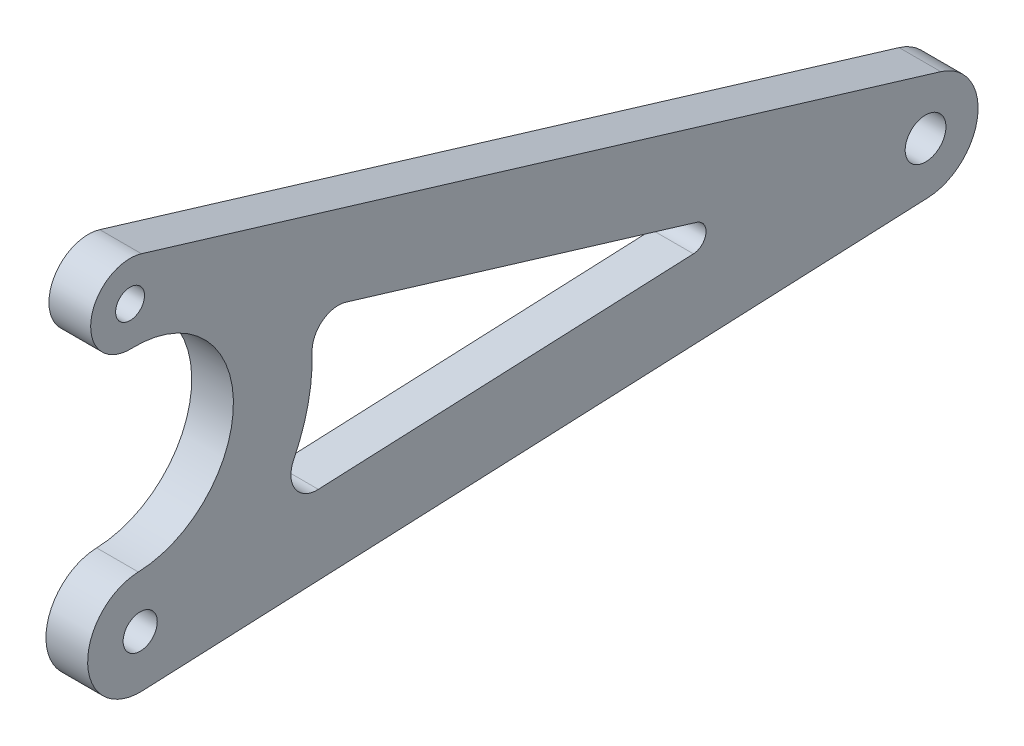
ISO-10303-21;
HEADER;
FILE_DESCRIPTION(('STEP AP214'),'2;1');
FILE_NAME('part.step','',(''),(''),'','','');
FILE_SCHEMA(('AUTOMOTIVE_DESIGN { 1 0 10303 214 1 1 1 1 }'));
ENDSEC;
DATA;
#1=APPLICATION_CONTEXT('core data for automotive mechanical design processes');
#2=APPLICATION_PROTOCOL_DEFINITION('international standard','automotive_design',2000,#1);
#3=PRODUCT_CONTEXT('',#1,'mechanical');
#4=PRODUCT('Part','Part','',(#3));
#5=PRODUCT_RELATED_PRODUCT_CATEGORY('part','',(#4));
#6=PRODUCT_DEFINITION_FORMATION('','',#4);
#7=PRODUCT_DEFINITION_CONTEXT('part definition',#1,'design');
#8=PRODUCT_DEFINITION('design','',#6,#7);
#9=PRODUCT_DEFINITION_SHAPE('','',#8);
#10=(LENGTH_UNIT() NAMED_UNIT(*) SI_UNIT(.MILLI.,.METRE.));
#11=(NAMED_UNIT(*) PLANE_ANGLE_UNIT() SI_UNIT($,.RADIAN.));
#12=(NAMED_UNIT(*) SI_UNIT($,.STERADIAN.) SOLID_ANGLE_UNIT());
#13=UNCERTAINTY_MEASURE_WITH_UNIT(LENGTH_MEASURE(1.E-05),#10,'distance_accuracy_value','');
#14=(GEOMETRIC_REPRESENTATION_CONTEXT(3) GLOBAL_UNCERTAINTY_ASSIGNED_CONTEXT((#13)) GLOBAL_UNIT_ASSIGNED_CONTEXT((#10,
#11,#12)) REPRESENTATION_CONTEXT('',''));
#15=CARTESIAN_POINT('',(0.,0.,0.));
#16=DIRECTION('',(0.,0.,1.));
#17=DIRECTION('',(1.,0.,0.));
#18=AXIS2_PLACEMENT_3D('',#15,#16,#17);
#19=CARTESIAN_POINT('',(14.14284,176.776695296636,176.776695296638));
#20=DIRECTION('',(-1.,0.,0.));
#21=DIRECTION('',(0.,0.,1.));
#22=AXIS2_PLACEMENT_3D('',#19,#20,#21);
#23=PLANE('',#22);
#24=DIRECTION('',(0.,0.0436193873653397,-0.999048221581858));
#25=VECTOR('',#24,1.);
#26=CARTESIAN_POINT('',(14.14284,179.19755656092,167.181027726338));
#27=LINE('',#26,#25);
#28=CARTESIAN_POINT('',(14.14284,179.370876706993,163.211343735848));
#29=VERTEX_POINT('',#28);
#30=CARTESIAN_POINT('',(14.14284,180.617968883603,134.648236905492));
#31=VERTEX_POINT('',#30);
#32=EDGE_CURVE('E164',#29,#31,#27,.T.);
#33=ORIENTED_EDGE('',*,*,#32,.F.);
#34=CARTESIAN_POINT('',(14.14284,181.368973150157,163.298582510579));
#35=DIRECTION('',(-1.,0.,0.));
#36=DIRECTION('',(0.,0.,1.));
#37=AXIS2_PLACEMENT_3D('',#34,#35,#36);
#38=CIRCLE('',#37,2.);
#39=CARTESIAN_POINT('',(14.14284,182.259649979283,165.089307164471));
#40=VERTEX_POINT('',#39);
#41=EDGE_CURVE('E50',#29,#40,#38,.T.);
#42=ORIENTED_EDGE('',*,*,#41,.T.);
#43=CARTESIAN_POINT('',(14.14284,188.273403115267,177.180085380396));
#44=DIRECTION('',(1.,0.,0.));
#45=DIRECTION('',(0.,0.,-1.));
#46=AXIS2_PLACEMENT_3D('',#43,#44,#45);
#47=CIRCLE('',#46,13.5037826051534);
#48=CARTESIAN_POINT('',(14.14284,188.682983667856,163.682515657732));
#49=VERTEX_POINT('',#48);
#50=EDGE_CURVE('E170',#49,#40,#47,.F.);
#51=ORIENTED_EDGE('',*,*,#50,.F.);
#52=CARTESIAN_POINT('',(14.14284,188.743645271284,161.683435826942));
#53=DIRECTION('',(-1.,0.,0.));
#54=DIRECTION('',(0.,0.,1.));
#55=AXIS2_PLACEMENT_3D('',#52,#53,#54);
#56=CIRCLE('',#55,2.);
#57=CARTESIAN_POINT('',(14.14284,190.657847872531,161.103928793872));
#58=VERTEX_POINT('',#57);
#59=EDGE_CURVE('E43',#49,#58,#56,.T.);
#60=ORIENTED_EDGE('',*,*,#59,.T.);
#61=DIRECTION('',(0.,0.289753516534974,0.95710130062372));
#62=VECTOR('',#61,1.);
#63=CARTESIAN_POINT('',(14.14284,180.873916630872,128.786069709408));
#64=LINE('',#63,#62);
#65=CARTESIAN_POINT('',(14.14284,182.574118405809,134.402102776322));
#66=VERTEX_POINT('',#65);
#67=EDGE_CURVE('E167',#66,#58,#64,.T.);
#68=ORIENTED_EDGE('',*,*,#67,.F.);
#69=CARTESIAN_POINT('',(14.14284,181.617017105185,134.691856292857));
#70=DIRECTION('',(-1.,0.,0.));
#71=DIRECTION('',(0.,0.,1.));
#72=AXIS2_PLACEMENT_3D('',#69,#70,#71);
#73=CIRCLE('',#72,1.);
#74=EDGE_CURVE('E186',#66,#31,#73,.T.);
#75=ORIENTED_EDGE('',*,*,#74,.T.);
#76=EDGE_LOOP('',(#33,#42,#51,#60,#68,#75));
#77=FACE_BOUND('',#76,.T.);
#78=CARTESIAN_POINT('',(14.14284,176.776695296636,176.776695296638));
#79=DIRECTION('',(1.,0.,0.));
#80=DIRECTION('',(0.,0.,1.));
#81=AXIS2_PLACEMENT_3D('',#78,#79,#80);
#82=CIRCLE('',#81,4.00000000000003);
#83=CARTESIAN_POINT('',(14.14284,180.774235310469,176.916958755224));
#84=VERTEX_POINT('',#83);
#85=CARTESIAN_POINT('',(14.14284,172.78050241031,176.602217747175));
#86=VERTEX_POINT('',#85);
#87=EDGE_CURVE('E135',#84,#86,#82,.T.);
#88=ORIENTED_EDGE('',*,*,#87,.T.);
#89=DIRECTION('',(0.,0.0436193873653399,-0.999048221581858));
#90=VECTOR('',#89,1.);
#91=CARTESIAN_POINT('',(14.14284,175.391522795918,116.800018993048));
#92=LINE('',#91,#90);
#93=CARTESIAN_POINT('',(14.14284,175.391522795918,116.800018993048));
#94=VERTEX_POINT('',#93);
#95=EDGE_CURVE('E124',#86,#94,#92,.T.);
#96=ORIENTED_EDGE('',*,*,#95,.T.);
#97=CARTESIAN_POINT('',(14.14284,179.387715682245,116.974496542509));
#98=DIRECTION('',(1.,0.,0.));
#99=DIRECTION('',(0.,0.,1.));
#100=AXIS2_PLACEMENT_3D('',#97,#98,#99);
#101=CIRCLE('',#100,4.00000000000002);
#102=CARTESIAN_POINT('',(14.14284,183.21612088474,115.81548247637));
#103=VERTEX_POINT('',#102);
#104=EDGE_CURVE('E134',#94,#103,#101,.T.);
#105=ORIENTED_EDGE('',*,*,#104,.T.);
#106=DIRECTION('',(0.,0.289753516534974,0.95710130062372));
#107=VECTOR('',#106,1.);
#108=CARTESIAN_POINT('',(14.14284,183.21612088474,115.81548247637));
#109=LINE('',#108,#107);
#110=CARTESIAN_POINT('',(14.14284,201.64202983231,176.679149049904));
#111=VERTEX_POINT('',#110);
#112=EDGE_CURVE('E387',#103,#111,#109,.T.);
#113=ORIENTED_EDGE('',*,*,#112,.T.);
#114=CARTESIAN_POINT('',(14.14284,198.770725930439,177.548409599509));
#115=DIRECTION('',(1.,0.,0.));
#116=DIRECTION('',(0.,0.,1.));
#117=AXIS2_PLACEMENT_3D('',#114,#115,#116);
#118=CIRCLE('',#117,3.);
#119=CARTESIAN_POINT('',(14.14284,195.772570920065,177.443212005568));
#120=VERTEX_POINT('',#119);
#121=EDGE_CURVE('E389',#111,#120,#118,.T.);
#122=ORIENTED_EDGE('',*,*,#121,.T.);
#123=CARTESIAN_POINT('',(14.14284,188.273403115267,177.180085380396));
#124=DIRECTION('',(-1.,0.,0.));
#125=DIRECTION('',(0.,0.,1.));
#126=AXIS2_PLACEMENT_3D('',#123,#124,#125);
#127=CIRCLE('',#126,7.50378260515293);
#128=EDGE_CURVE('E140',#120,#84,#127,.T.);
#129=ORIENTED_EDGE('',*,*,#128,.T.);
#130=EDGE_LOOP('',(#88,#96,#105,#113,#122,#129));
#131=FACE_BOUND('',#130,.T.);
#132=CARTESIAN_POINT('',(14.14284,179.387715682245,116.974496542509));
#133=DIRECTION('',(1.,0.,0.));
#134=DIRECTION('',(0.,0.,-1.));
#135=AXIS2_PLACEMENT_3D('',#132,#133,#134);
#136=CIRCLE('',#135,1.54999999999999);
#137=CARTESIAN_POINT('',(14.14284,179.387715682245,115.424496542509));
#138=VERTEX_POINT('',#137);
#139=EDGE_CURVE('E381',#138,#138,#136,.T.);
#140=ORIENTED_EDGE('',*,*,#139,.F.);
#141=EDGE_LOOP('',(#140));
#142=FACE_BOUND('',#141,.T.);
#143=CARTESIAN_POINT('',(14.14284,198.770725930439,177.548409599509));
#144=DIRECTION('',(1.,0.,0.));
#145=DIRECTION('',(0.,0.,-1.));
#146=AXIS2_PLACEMENT_3D('',#143,#144,#145);
#147=CIRCLE('',#146,1.09999999999999);
#148=CARTESIAN_POINT('',(14.14284,198.770725930439,176.448409599509));
#149=VERTEX_POINT('',#148);
#150=EDGE_CURVE('E375',#149,#149,#147,.T.);
#151=ORIENTED_EDGE('',*,*,#150,.F.);
#152=EDGE_LOOP('',(#151));
#153=FACE_BOUND('',#152,.T.);
#154=CARTESIAN_POINT('',(14.14284,176.776695296636,176.776695296638));
#155=DIRECTION('',(1.,0.,0.));
#156=DIRECTION('',(0.,0.,-1.));
#157=AXIS2_PLACEMENT_3D('',#154,#155,#156);
#158=CIRCLE('',#157,1.30000000000001);
#159=CARTESIAN_POINT('',(14.14284,176.776695296636,175.476695296638));
#160=VERTEX_POINT('',#159);
#161=EDGE_CURVE('E367',#160,#160,#158,.T.);
#162=ORIENTED_EDGE('',*,*,#161,.F.);
#163=EDGE_LOOP('',(#162));
#164=FACE_BOUND('',#163,.T.);
#165=ADVANCED_FACE('F35',(#77,#131,#142,#153,#164),#23,.F.);
#166=CARTESIAN_POINT('',(10.96784,176.776695296636,176.776695296638));
#167=DIRECTION('',(-1.,0.,0.));
#168=DIRECTION('',(0.,0.,1.));
#169=AXIS2_PLACEMENT_3D('',#166,#167,#168);
#170=PLANE('',#169);
#171=CARTESIAN_POINT('',(10.96784,188.273403115267,177.180085380396));
#172=DIRECTION('',(-1.,0.,0.));
#173=DIRECTION('',(0.,0.,1.));
#174=AXIS2_PLACEMENT_3D('',#171,#172,#173);
#175=CIRCLE('',#174,13.5037826051534);
#176=CARTESIAN_POINT('',(10.96784,182.259649979283,165.089307164471));
#177=VERTEX_POINT('',#176);
#178=CARTESIAN_POINT('',(10.96784,188.682983667856,163.682515657732));
#179=VERTEX_POINT('',#178);
#180=EDGE_CURVE('E160',#177,#179,#175,.F.);
#181=ORIENTED_EDGE('',*,*,#180,.F.);
#182=CARTESIAN_POINT('',(10.96784,181.368973150157,163.298582510579));
#183=DIRECTION('',(-1.,0.,0.));
#184=DIRECTION('',(0.,0.,1.));
#185=AXIS2_PLACEMENT_3D('',#182,#183,#184);
#186=CIRCLE('',#185,2.);
#187=CARTESIAN_POINT('',(10.96784,179.370876706993,163.211343735848));
#188=VERTEX_POINT('',#187);
#189=EDGE_CURVE('E191',#177,#188,#186,.F.);
#190=ORIENTED_EDGE('',*,*,#189,.T.);
#191=DIRECTION('',(0.,-0.0436193873653397,0.999048221581858));
#192=VECTOR('',#191,1.);
#193=CARTESIAN_POINT('',(10.96784,178.774791739801,176.863934071369));
#194=LINE('',#193,#192);
#195=CARTESIAN_POINT('',(10.96784,180.617968883603,134.648236905492));
#196=VERTEX_POINT('',#195);
#197=EDGE_CURVE('E149',#196,#188,#194,.T.);
#198=ORIENTED_EDGE('',*,*,#197,.F.);
#199=CARTESIAN_POINT('',(10.96784,181.617017105185,134.691856292857));
#200=DIRECTION('',(-1.,0.,0.));
#201=DIRECTION('',(0.,0.,1.));
#202=AXIS2_PLACEMENT_3D('',#199,#200,#201);
#203=CIRCLE('',#202,1.);
#204=CARTESIAN_POINT('',(10.96784,182.574118405809,134.402102776322));
#205=VERTEX_POINT('',#204);
#206=EDGE_CURVE('E188',#196,#205,#203,.F.);
#207=ORIENTED_EDGE('',*,*,#206,.T.);
#208=DIRECTION('',(0.,-0.289753516534974,-0.95710130062372));
#209=VECTOR('',#208,1.);
#210=CARTESIAN_POINT('',(10.96784,193.838852505249,171.611285900949));
#211=LINE('',#210,#209);
#212=CARTESIAN_POINT('',(10.96784,190.657847872531,161.103928793872));
#213=VERTEX_POINT('',#212);
#214=EDGE_CURVE('E152',#213,#205,#211,.T.);
#215=ORIENTED_EDGE('',*,*,#214,.F.);
#216=CARTESIAN_POINT('',(10.96784,188.743645271284,161.683435826942));
#217=DIRECTION('',(-1.,0.,0.));
#218=DIRECTION('',(0.,0.,1.));
#219=AXIS2_PLACEMENT_3D('',#216,#217,#218);
#220=CIRCLE('',#219,2.);
#221=EDGE_CURVE('E12',#213,#179,#220,.F.);
#222=ORIENTED_EDGE('',*,*,#221,.T.);
#223=EDGE_LOOP('',(#181,#190,#198,#207,#215,#222));
#224=FACE_BOUND('',#223,.T.);
#225=CARTESIAN_POINT('',(10.96784,198.770725930439,177.548409599509));
#226=DIRECTION('',(1.,0.,0.));
#227=DIRECTION('',(0.,0.,-1.));
#228=AXIS2_PLACEMENT_3D('',#225,#226,#227);
#229=CIRCLE('',#228,1.09999999999999);
#230=CARTESIAN_POINT('',(10.96784,198.770725930439,176.448409599509));
#231=VERTEX_POINT('',#230);
#232=EDGE_CURVE('E372',#231,#231,#229,.T.);
#233=ORIENTED_EDGE('',*,*,#232,.T.);
#234=EDGE_LOOP('',(#233));
#235=FACE_BOUND('',#234,.T.);
#236=CARTESIAN_POINT('',(10.96784,176.776695296636,176.776695296638));
#237=DIRECTION('',(1.,0.,0.));
#238=DIRECTION('',(0.,0.,1.));
#239=AXIS2_PLACEMENT_3D('',#236,#237,#238);
#240=CIRCLE('',#239,4.00000000000003);
#241=CARTESIAN_POINT('',(10.96784,180.774235310469,176.916958755224));
#242=VERTEX_POINT('',#241);
#243=CARTESIAN_POINT('',(10.96784,172.78050241031,176.602217747175));
#244=VERTEX_POINT('',#243);
#245=EDGE_CURVE('E148',#242,#244,#240,.T.);
#246=ORIENTED_EDGE('',*,*,#245,.F.);
#247=CARTESIAN_POINT('',(10.96784,188.273403115267,177.180085380396));
#248=DIRECTION('',(-1.,0.,0.));
#249=DIRECTION('',(0.,0.,1.));
#250=AXIS2_PLACEMENT_3D('',#247,#248,#249);
#251=CIRCLE('',#250,7.50378260515293);
#252=CARTESIAN_POINT('',(10.96784,195.772570920065,177.443212005568));
#253=VERTEX_POINT('',#252);
#254=EDGE_CURVE('E144',#253,#242,#251,.T.);
#255=ORIENTED_EDGE('',*,*,#254,.F.);
#256=CARTESIAN_POINT('',(10.96784,198.770725930439,177.548409599509));
#257=DIRECTION('',(1.,0.,0.));
#258=DIRECTION('',(0.,0.,1.));
#259=AXIS2_PLACEMENT_3D('',#256,#257,#258);
#260=CIRCLE('',#259,3.);
#261=CARTESIAN_POINT('',(10.96784,201.64202983231,176.679149049904));
#262=VERTEX_POINT('',#261);
#263=EDGE_CURVE('E400',#262,#253,#260,.T.);
#264=ORIENTED_EDGE('',*,*,#263,.F.);
#265=DIRECTION('',(0.,0.289753516534974,0.95710130062372));
#266=VECTOR('',#265,1.);
#267=CARTESIAN_POINT('',(10.96784,183.21612088474,115.81548247637));
#268=LINE('',#267,#266);
#269=CARTESIAN_POINT('',(10.96784,183.21612088474,115.81548247637));
#270=VERTEX_POINT('',#269);
#271=EDGE_CURVE('E398',#270,#262,#268,.T.);
#272=ORIENTED_EDGE('',*,*,#271,.F.);
#273=CARTESIAN_POINT('',(10.96784,179.387715682245,116.974496542509));
#274=DIRECTION('',(1.,0.,0.));
#275=DIRECTION('',(0.,0.,1.));
#276=AXIS2_PLACEMENT_3D('',#273,#274,#275);
#277=CIRCLE('',#276,4.00000000000002);
#278=CARTESIAN_POINT('',(10.96784,175.391522795918,116.800018993048));
#279=VERTEX_POINT('',#278);
#280=EDGE_CURVE('E396',#279,#270,#277,.T.);
#281=ORIENTED_EDGE('',*,*,#280,.F.);
#282=DIRECTION('',(0.,0.0436193873653399,-0.999048221581858));
#283=VECTOR('',#282,1.);
#284=CARTESIAN_POINT('',(10.96784,175.391522795918,116.800018993048));
#285=LINE('',#284,#283);
#286=EDGE_CURVE('E394',#244,#279,#285,.T.);
#287=ORIENTED_EDGE('',*,*,#286,.F.);
#288=EDGE_LOOP('',(#246,#255,#264,#272,#281,#287));
#289=FACE_BOUND('',#288,.T.);
#290=CARTESIAN_POINT('',(10.96784,179.387715682245,116.974496542509));
#291=DIRECTION('',(1.,0.,0.));
#292=DIRECTION('',(0.,0.,-1.));
#293=AXIS2_PLACEMENT_3D('',#290,#291,#292);
#294=CIRCLE('',#293,1.54999999999999);
#295=CARTESIAN_POINT('',(10.96784,179.387715682245,115.424496542509));
#296=VERTEX_POINT('',#295);
#297=EDGE_CURVE('E378',#296,#296,#294,.T.);
#298=ORIENTED_EDGE('',*,*,#297,.T.);
#299=EDGE_LOOP('',(#298));
#300=FACE_BOUND('',#299,.T.);
#301=CARTESIAN_POINT('',(10.96784,176.776695296636,176.776695296638));
#302=DIRECTION('',(1.,0.,0.));
#303=DIRECTION('',(0.,0.,-1.));
#304=AXIS2_PLACEMENT_3D('',#301,#302,#303);
#305=CIRCLE('',#304,1.30000000000001);
#306=CARTESIAN_POINT('',(10.96784,176.776695296636,175.476695296638));
#307=VERTEX_POINT('',#306);
#308=EDGE_CURVE('E172',#307,#307,#305,.T.);
#309=ORIENTED_EDGE('',*,*,#308,.T.);
#310=EDGE_LOOP('',(#309));
#311=FACE_BOUND('',#310,.T.);
#312=ADVANCED_FACE('F200',(#224,#235,#289,#300,#311),#170,.T.);
#313=CARTESIAN_POINT('',(14.14284,176.776695296636,176.776695296638));
#314=DIRECTION('',(-1.,0.,0.));
#315=DIRECTION('',(0.,0.,1.));
#316=AXIS2_PLACEMENT_3D('',#313,#314,#315);
#317=CYLINDRICAL_SURFACE('',#316,4.00000000000003);
#318=ORIENTED_EDGE('',*,*,#245,.T.);
#319=DIRECTION('',(-1.,0.,0.));
#320=VECTOR('',#319,1.);
#321=CARTESIAN_POINT('',(14.14284,172.78050241031,176.602217747175));
#322=LINE('',#321,#320);
#323=EDGE_CURVE('E128',#86,#244,#322,.T.);
#324=ORIENTED_EDGE('',*,*,#323,.F.);
#325=ORIENTED_EDGE('',*,*,#87,.F.);
#326=DIRECTION('',(-1.,0.,0.));
#327=VECTOR('',#326,1.);
#328=CARTESIAN_POINT('',(14.14284,180.774235310469,176.916958755224));
#329=LINE('',#328,#327);
#330=EDGE_CURVE('E392',#84,#242,#329,.T.);
#331=ORIENTED_EDGE('',*,*,#330,.T.);
#332=EDGE_LOOP('',(#318,#324,#325,#331));
#333=FACE_BOUND('',#332,.T.);
#334=ADVANCED_FACE('F146',(#333),#317,.T.);
#335=CARTESIAN_POINT('',(14.14284,175.391522795918,116.800018993048));
#336=DIRECTION('',(0.,0.999048221581857,0.0436193873653399));
#337=DIRECTION('',(0.,-0.0436193873653399,0.999048221581858));
#338=AXIS2_PLACEMENT_3D('',#335,#336,#337);
#339=PLANE('',#338);
#340=ORIENTED_EDGE('',*,*,#286,.T.);
#341=DIRECTION('',(-1.,0.,0.));
#342=VECTOR('',#341,1.);
#343=CARTESIAN_POINT('',(14.14284,175.391522795918,116.800018993048));
#344=LINE('',#343,#342);
#345=EDGE_CURVE('E131',#94,#279,#344,.T.);
#346=ORIENTED_EDGE('',*,*,#345,.F.);
#347=ORIENTED_EDGE('',*,*,#95,.F.);
#348=ORIENTED_EDGE('',*,*,#323,.T.);
#349=EDGE_LOOP('',(#340,#346,#347,#348));
#350=FACE_BOUND('',#349,.T.);
#351=ADVANCED_FACE('F126',(#350),#339,.F.);
#352=CARTESIAN_POINT('',(14.14284,179.387715682245,116.974496542509));
#353=DIRECTION('',(-1.,0.,0.));
#354=DIRECTION('',(0.,0.,1.));
#355=AXIS2_PLACEMENT_3D('',#352,#353,#354);
#356=CYLINDRICAL_SURFACE('',#355,4.00000000000002);
#357=ORIENTED_EDGE('',*,*,#280,.T.);
#358=DIRECTION('',(-1.,0.,0.));
#359=VECTOR('',#358,1.);
#360=CARTESIAN_POINT('',(14.14284,183.21612088474,115.81548247637));
#361=LINE('',#360,#359);
#362=EDGE_CURVE('E154',#103,#270,#361,.T.);
#363=ORIENTED_EDGE('',*,*,#362,.F.);
#364=ORIENTED_EDGE('',*,*,#104,.F.);
#365=ORIENTED_EDGE('',*,*,#345,.T.);
#366=EDGE_LOOP('',(#357,#363,#364,#365));
#367=FACE_BOUND('',#366,.T.);
#368=ADVANCED_FACE('F245',(#367),#356,.T.);
#369=CARTESIAN_POINT('',(14.14284,183.21612088474,115.81548247637));
#370=DIRECTION('',(0.,-0.95710130062372,0.289753516534974));
#371=DIRECTION('',(0.,-0.289753516534975,-0.95710130062372));
#372=AXIS2_PLACEMENT_3D('',#369,#370,#371);
#373=PLANE('',#372);
#374=ORIENTED_EDGE('',*,*,#271,.T.);
#375=DIRECTION('',(-1.,0.,0.));
#376=VECTOR('',#375,1.);
#377=CARTESIAN_POINT('',(14.14284,201.64202983231,176.679149049904));
#378=LINE('',#377,#376);
#379=EDGE_CURVE('E407',#111,#262,#378,.T.);
#380=ORIENTED_EDGE('',*,*,#379,.F.);
#381=ORIENTED_EDGE('',*,*,#112,.F.);
#382=ORIENTED_EDGE('',*,*,#362,.T.);
#383=EDGE_LOOP('',(#374,#380,#381,#382));
#384=FACE_BOUND('',#383,.T.);
#385=ADVANCED_FACE('F241',(#384),#373,.F.);
#386=CARTESIAN_POINT('',(14.14284,198.770725930439,177.548409599509));
#387=DIRECTION('',(-1.,0.,0.));
#388=DIRECTION('',(0.,0.,1.));
#389=AXIS2_PLACEMENT_3D('',#386,#387,#388);
#390=CYLINDRICAL_SURFACE('',#389,3.);
#391=ORIENTED_EDGE('',*,*,#263,.T.);
#392=DIRECTION('',(-1.,0.,0.));
#393=VECTOR('',#392,1.);
#394=CARTESIAN_POINT('',(14.14284,195.772570920065,177.443212005568));
#395=LINE('',#394,#393);
#396=EDGE_CURVE('E404',#120,#253,#395,.T.);
#397=ORIENTED_EDGE('',*,*,#396,.F.);
#398=ORIENTED_EDGE('',*,*,#121,.F.);
#399=ORIENTED_EDGE('',*,*,#379,.T.);
#400=EDGE_LOOP('',(#391,#397,#398,#399));
#401=FACE_BOUND('',#400,.T.);
#402=ADVANCED_FACE('F237',(#401),#390,.T.);
#403=CARTESIAN_POINT('',(14.14284,188.273403115267,177.180085380396));
#404=DIRECTION('',(-1.,0.,0.));
#405=DIRECTION('',(0.,0.,1.));
#406=AXIS2_PLACEMENT_3D('',#403,#404,#405);
#407=CYLINDRICAL_SURFACE('',#406,7.50378260515293);
#408=ORIENTED_EDGE('',*,*,#254,.T.);
#409=ORIENTED_EDGE('',*,*,#330,.F.);
#410=ORIENTED_EDGE('',*,*,#128,.F.);
#411=ORIENTED_EDGE('',*,*,#396,.T.);
#412=EDGE_LOOP('',(#408,#409,#410,#411));
#413=FACE_BOUND('',#412,.T.);
#414=ADVANCED_FACE('F234',(#413),#407,.F.);
#415=CARTESIAN_POINT('',(14.14284,179.387715682245,116.974496542509));
#416=DIRECTION('',(-1.,0.,0.));
#417=DIRECTION('',(0.,0.,1.));
#418=AXIS2_PLACEMENT_3D('',#415,#416,#417);
#419=CYLINDRICAL_SURFACE('',#418,1.54999999999999);
#420=ORIENTED_EDGE('',*,*,#139,.T.);
#421=EDGE_LOOP('',(#420));
#422=FACE_BOUND('',#421,.T.);
#423=ORIENTED_EDGE('',*,*,#297,.F.);
#424=EDGE_LOOP('',(#423));
#425=FACE_BOUND('',#424,.T.);
#426=ADVANCED_FACE('F231',(#422,#425),#419,.F.);
#427=CARTESIAN_POINT('',(14.14284,198.770725930439,177.548409599509));
#428=DIRECTION('',(-1.,0.,0.));
#429=DIRECTION('',(0.,0.,1.));
#430=AXIS2_PLACEMENT_3D('',#427,#428,#429);
#431=CYLINDRICAL_SURFACE('',#430,1.09999999999999);
#432=ORIENTED_EDGE('',*,*,#150,.T.);
#433=EDGE_LOOP('',(#432));
#434=FACE_BOUND('',#433,.T.);
#435=ORIENTED_EDGE('',*,*,#232,.F.);
#436=EDGE_LOOP('',(#435));
#437=FACE_BOUND('',#436,.T.);
#438=ADVANCED_FACE('F288',(#434,#437),#431,.F.);
#439=CARTESIAN_POINT('',(14.14284,176.776695296636,176.776695296638));
#440=DIRECTION('',(-1.,0.,0.));
#441=DIRECTION('',(0.,0.,1.));
#442=AXIS2_PLACEMENT_3D('',#439,#440,#441);
#443=CYLINDRICAL_SURFACE('',#442,1.30000000000001);
#444=ORIENTED_EDGE('',*,*,#161,.T.);
#445=EDGE_LOOP('',(#444));
#446=FACE_BOUND('',#445,.T.);
#447=ORIENTED_EDGE('',*,*,#308,.F.);
#448=EDGE_LOOP('',(#447));
#449=FACE_BOUND('',#448,.T.);
#450=ADVANCED_FACE('F296',(#446,#449),#443,.F.);
#451=CARTESIAN_POINT('',(-18.7856456,188.273403115267,177.180085380396));
#452=DIRECTION('',(1.,0.,0.));
#453=DIRECTION('',(0.,0.,-1.));
#454=AXIS2_PLACEMENT_3D('',#451,#452,#453);
#455=CYLINDRICAL_SURFACE('',#454,13.5037826051534);
#456=ORIENTED_EDGE('',*,*,#50,.T.);
#457=DIRECTION('',(1.,0.,0.));
#458=VECTOR('',#457,1.);
#459=CARTESIAN_POINT('',(-18.7856456,182.259649979283,165.089307164471));
#460=LINE('',#459,#458);
#461=EDGE_CURVE('E184',#40,#177,#460,.F.);
#462=ORIENTED_EDGE('',*,*,#461,.T.);
#463=ORIENTED_EDGE('',*,*,#180,.T.);
#464=DIRECTION('',(1.,0.,0.));
#465=VECTOR('',#464,1.);
#466=CARTESIAN_POINT('',(-18.7856456,188.682983667856,163.682515657732));
#467=LINE('',#466,#465);
#468=EDGE_CURVE('E182',#179,#49,#467,.T.);
#469=ORIENTED_EDGE('',*,*,#468,.T.);
#470=EDGE_LOOP('',(#456,#462,#463,#469));
#471=FACE_BOUND('',#470,.T.);
#472=ADVANCED_FACE('F204',(#471),#455,.T.);
#473=CARTESIAN_POINT('',(-18.7856456,180.873916630872,128.786069709408));
#474=DIRECTION('',(0.,0.95710130062372,-0.289753516534974));
#475=DIRECTION('',(0.,0.289753516534974,0.95710130062372));
#476=AXIS2_PLACEMENT_3D('',#473,#474,#475);
#477=PLANE('',#476);
#478=ORIENTED_EDGE('',*,*,#214,.T.);
#479=DIRECTION('',(1.,0.,0.));
#480=VECTOR('',#479,1.);
#481=CARTESIAN_POINT('',(14.14284,182.574118405809,134.402102776322));
#482=LINE('',#481,#480);
#483=EDGE_CURVE('E174',#205,#66,#482,.T.);
#484=ORIENTED_EDGE('',*,*,#483,.T.);
#485=ORIENTED_EDGE('',*,*,#67,.T.);
#486=DIRECTION('',(-1.,0.,0.));
#487=VECTOR('',#486,1.);
#488=CARTESIAN_POINT('',(10.96784,190.657847872531,161.103928793872));
#489=LINE('',#488,#487);
#490=EDGE_CURVE('E163',#58,#213,#489,.T.);
#491=ORIENTED_EDGE('',*,*,#490,.T.);
#492=EDGE_LOOP('',(#478,#484,#485,#491));
#493=FACE_BOUND('',#492,.T.);
#494=ADVANCED_FACE('F194',(#493),#477,.F.);
#495=CARTESIAN_POINT('',(-18.7856456,179.19755656092,167.181027726338));
#496=DIRECTION('',(0.,-0.999048221581858,-0.0436193873653397));
#497=DIRECTION('',(0.,0.0436193873653397,-0.999048221581858));
#498=AXIS2_PLACEMENT_3D('',#495,#496,#497);
#499=PLANE('',#498);
#500=ORIENTED_EDGE('',*,*,#32,.T.);
#501=DIRECTION('',(1.,0.,0.));
#502=VECTOR('',#501,1.);
#503=CARTESIAN_POINT('',(10.96784,180.617968883603,134.648236905492));
#504=LINE('',#503,#502);
#505=EDGE_CURVE('E180',#31,#196,#504,.F.);
#506=ORIENTED_EDGE('',*,*,#505,.T.);
#507=ORIENTED_EDGE('',*,*,#197,.T.);
#508=DIRECTION('',(-1.,0.,0.));
#509=VECTOR('',#508,1.);
#510=CARTESIAN_POINT('',(14.14284,179.370876706993,163.211343735848));
#511=LINE('',#510,#509);
#512=EDGE_CURVE('E177',#188,#29,#511,.F.);
#513=ORIENTED_EDGE('',*,*,#512,.T.);
#514=EDGE_LOOP('',(#500,#506,#507,#513));
#515=FACE_BOUND('',#514,.T.);
#516=ADVANCED_FACE('F212',(#515),#499,.F.);
#517=CARTESIAN_POINT('',(-18.7856456,181.617017105185,134.691856292857));
#518=DIRECTION('',(-1.,0.,0.));
#519=DIRECTION('',(0.,0.,1.));
#520=AXIS2_PLACEMENT_3D('',#517,#518,#519);
#521=CYLINDRICAL_SURFACE('',#520,1.);
#522=ORIENTED_EDGE('',*,*,#206,.F.);
#523=ORIENTED_EDGE('',*,*,#505,.F.);
#524=ORIENTED_EDGE('',*,*,#74,.F.);
#525=ORIENTED_EDGE('',*,*,#483,.F.);
#526=EDGE_LOOP('',(#522,#523,#524,#525));
#527=FACE_BOUND('',#526,.T.);
#528=ADVANCED_FACE('F215',(#527),#521,.F.);
#529=CARTESIAN_POINT('',(-18.7856456,181.368973150157,163.298582510579));
#530=DIRECTION('',(1.,0.,0.));
#531=DIRECTION('',(0.,0.,-1.));
#532=AXIS2_PLACEMENT_3D('',#529,#530,#531);
#533=CYLINDRICAL_SURFACE('',#532,2.);
#534=ORIENTED_EDGE('',*,*,#189,.F.);
#535=ORIENTED_EDGE('',*,*,#461,.F.);
#536=ORIENTED_EDGE('',*,*,#41,.F.);
#537=ORIENTED_EDGE('',*,*,#512,.F.);
#538=EDGE_LOOP('',(#534,#535,#536,#537));
#539=FACE_BOUND('',#538,.T.);
#540=ADVANCED_FACE('F207',(#539),#533,.F.);
#541=CARTESIAN_POINT('',(-18.7856456,188.743645271284,161.683435826942));
#542=DIRECTION('',(1.,0.,0.));
#543=DIRECTION('',(0.,0.,-1.));
#544=AXIS2_PLACEMENT_3D('',#541,#542,#543);
#545=CYLINDRICAL_SURFACE('',#544,2.);
#546=ORIENTED_EDGE('',*,*,#221,.F.);
#547=ORIENTED_EDGE('',*,*,#490,.F.);
#548=ORIENTED_EDGE('',*,*,#59,.F.);
#549=ORIENTED_EDGE('',*,*,#468,.F.);
#550=EDGE_LOOP('',(#546,#547,#548,#549));
#551=FACE_BOUND('',#550,.T.);
#552=ADVANCED_FACE('F37',(#551),#545,.F.);
#553=CLOSED_SHELL('',(#165,#312,#334,#351,#368,#385,#402,#414,#426,#438,#450,#472,#494,#516,
#528,#540,#552));
#554=MANIFOLD_SOLID_BREP('B2',#553);
#555=ADVANCED_BREP_SHAPE_REPRESENTATION('',(#18,#554),#14);
#556=SHAPE_DEFINITION_REPRESENTATION(#9,#555);
ENDSEC;
END-ISO-10303-21;
